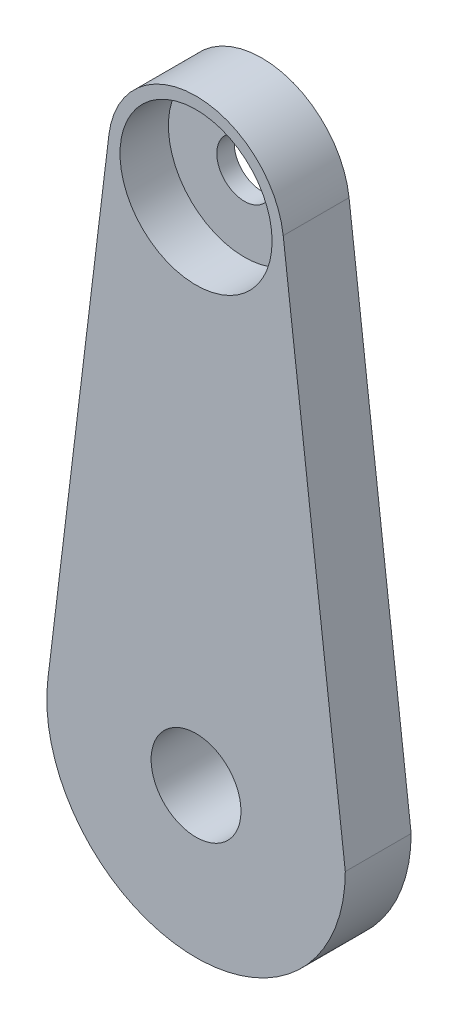
ISO-10303-21;
HEADER;
FILE_DESCRIPTION(('STEP AP214'),'2;1');
FILE_NAME('part.step','',(''),(''),'','','');
FILE_SCHEMA(('AUTOMOTIVE_DESIGN { 1 0 10303 214 1 1 1 1 }'));
ENDSEC;
DATA;
#1=APPLICATION_CONTEXT('core data for automotive mechanical design processes');
#2=APPLICATION_PROTOCOL_DEFINITION('international standard','automotive_design',2000,#1);
#3=PRODUCT_CONTEXT('',#1,'mechanical');
#4=PRODUCT('Part','Part','',(#3));
#5=PRODUCT_RELATED_PRODUCT_CATEGORY('part','',(#4));
#6=PRODUCT_DEFINITION_FORMATION('','',#4);
#7=PRODUCT_DEFINITION_CONTEXT('part definition',#1,'design');
#8=PRODUCT_DEFINITION('design','',#6,#7);
#9=PRODUCT_DEFINITION_SHAPE('','',#8);
#10=(LENGTH_UNIT() NAMED_UNIT(*) SI_UNIT(.MILLI.,.METRE.));
#11=(NAMED_UNIT(*) PLANE_ANGLE_UNIT() SI_UNIT($,.RADIAN.));
#12=(NAMED_UNIT(*) SI_UNIT($,.STERADIAN.) SOLID_ANGLE_UNIT());
#13=UNCERTAINTY_MEASURE_WITH_UNIT(LENGTH_MEASURE(1.E-05),#10,'distance_accuracy_value','');
#14=(GEOMETRIC_REPRESENTATION_CONTEXT(3) GLOBAL_UNCERTAINTY_ASSIGNED_CONTEXT((#13)) GLOBAL_UNIT_ASSIGNED_CONTEXT((#10,
#11,#12)) REPRESENTATION_CONTEXT('',''));
#15=CARTESIAN_POINT('',(0.,0.,0.));
#16=DIRECTION('',(0.,0.,1.));
#17=DIRECTION('',(1.,0.,0.));
#18=AXIS2_PLACEMENT_3D('',#15,#16,#17);
#19=CARTESIAN_POINT('',(0.,73.66,9.525));
#20=DIRECTION('',(0.,0.,-1.));
#21=DIRECTION('',(-1.,0.,0.));
#22=AXIS2_PLACEMENT_3D('',#19,#20,#21);
#23=CYLINDRICAL_SURFACE('',#22,11.);
#24=CARTESIAN_POINT('',(0.,73.66,2.52476));
#25=DIRECTION('',(0.,0.,1.));
#26=DIRECTION('',(1.,0.,0.));
#27=AXIS2_PLACEMENT_3D('',#24,#25,#26);
#28=CIRCLE('',#27,11.);
#29=CARTESIAN_POINT('',(11.,73.66,2.52476));
#30=VERTEX_POINT('',#29);
#31=EDGE_CURVE('E12',#30,#30,#28,.T.);
#32=ORIENTED_EDGE('',*,*,#31,.F.);
#33=EDGE_LOOP('',(#32));
#34=FACE_BOUND('',#33,.T.);
#35=CARTESIAN_POINT('',(0.,73.66,9.525));
#36=DIRECTION('',(0.,0.,1.));
#37=DIRECTION('',(1.,0.,0.));
#38=AXIS2_PLACEMENT_3D('',#35,#36,#37);
#39=CIRCLE('',#38,11.);
#40=CARTESIAN_POINT('',(11.,73.66,9.525));
#41=VERTEX_POINT('',#40);
#42=EDGE_CURVE('E119',#41,#41,#39,.T.);
#43=ORIENTED_EDGE('',*,*,#42,.T.);
#44=EDGE_LOOP('',(#43));
#45=FACE_BOUND('',#44,.T.);
#46=ADVANCED_FACE('F55',(#34,#45),#23,.F.);
#47=CARTESIAN_POINT('',(0.,73.66,9.525));
#48=DIRECTION('',(0.,0.,-1.));
#49=DIRECTION('',(-1.,0.,0.));
#50=AXIS2_PLACEMENT_3D('',#47,#48,#49);
#51=CYLINDRICAL_SURFACE('',#50,12.7);
#52=CARTESIAN_POINT('',(0.,73.66,0.));
#53=DIRECTION('',(0.,0.,1.));
#54=DIRECTION('',(1.,0.,0.));
#55=AXIS2_PLACEMENT_3D('',#52,#53,#54);
#56=CIRCLE('',#55,12.7);
#57=CARTESIAN_POINT('',(12.6103341085492,75.1664772387127,0.));
#58=VERTEX_POINT('',#57);
#59=CARTESIAN_POINT('',(-12.6071666527694,75.1927586206897,0.));
#60=VERTEX_POINT('',#59);
#61=EDGE_CURVE('E114',#58,#60,#56,.T.);
#62=ORIENTED_EDGE('',*,*,#61,.T.);
#63=DIRECTION('',(0.,0.,-1.));
#64=VECTOR('',#63,1.);
#65=CARTESIAN_POINT('',(-12.6071666527694,75.1927586206897,9.525));
#66=LINE('',#65,#64);
#67=CARTESIAN_POINT('',(-12.6071666527694,75.1927586206897,9.525));
#68=VERTEX_POINT('',#67);
#69=EDGE_CURVE('E111',#68,#60,#66,.T.);
#70=ORIENTED_EDGE('',*,*,#69,.F.);
#71=CARTESIAN_POINT('',(0.,73.66,9.525));
#72=DIRECTION('',(0.,0.,1.));
#73=DIRECTION('',(1.,0.,0.));
#74=AXIS2_PLACEMENT_3D('',#71,#72,#73);
#75=CIRCLE('',#74,12.7);
#76=CARTESIAN_POINT('',(12.6103341085492,75.1664772387127,9.525));
#77=VERTEX_POINT('',#76);
#78=EDGE_CURVE('E102',#77,#68,#75,.T.);
#79=ORIENTED_EDGE('',*,*,#78,.F.);
#80=DIRECTION('',(0.,0.,-1.));
#81=VECTOR('',#80,1.);
#82=CARTESIAN_POINT('',(12.6103341085492,75.1664772387127,9.525));
#83=LINE('',#82,#81);
#84=EDGE_CURVE('E64',#77,#58,#83,.T.);
#85=ORIENTED_EDGE('',*,*,#84,.T.);
#86=EDGE_LOOP('',(#62,#70,#79,#85));
#87=FACE_BOUND('',#86,.T.);
#88=ADVANCED_FACE('F112',(#87),#51,.T.);
#89=CARTESIAN_POINT('',(-21.432183309708,2.60568965517242,9.525));
#90=DIRECTION('',(0.99269028761964,-0.120689655172414,0.));
#91=DIRECTION('',(0.120689655172414,0.99269028761964,0.));
#92=AXIS2_PLACEMENT_3D('',#89,#90,#91);
#93=PLANE('',#92);
#94=DIRECTION('',(-0.120689655172414,-0.99269028761964,0.));
#95=VECTOR('',#94,1.);
#96=CARTESIAN_POINT('',(-21.432183309708,2.60568965517242,0.));
#97=LINE('',#96,#95);
#98=CARTESIAN_POINT('',(-21.432183309708,2.60568965517241,0.));
#99=VERTEX_POINT('',#98);
#100=EDGE_CURVE('E89',#60,#99,#97,.T.);
#101=ORIENTED_EDGE('',*,*,#100,.T.);
#102=DIRECTION('',(0.,0.,-1.));
#103=VECTOR('',#102,1.);
#104=CARTESIAN_POINT('',(-21.432183309708,2.60568965517241,9.525));
#105=LINE('',#104,#103);
#106=CARTESIAN_POINT('',(-21.432183309708,2.60568965517241,9.525));
#107=VERTEX_POINT('',#106);
#108=EDGE_CURVE('E115',#107,#99,#105,.T.);
#109=ORIENTED_EDGE('',*,*,#108,.F.);
#110=DIRECTION('',(-0.120689655172414,-0.99269028761964,0.));
#111=VECTOR('',#110,1.);
#112=CARTESIAN_POINT('',(-21.432183309708,2.60568965517242,9.525));
#113=LINE('',#112,#111);
#114=EDGE_CURVE('E107',#68,#107,#113,.T.);
#115=ORIENTED_EDGE('',*,*,#114,.F.);
#116=ORIENTED_EDGE('',*,*,#69,.T.);
#117=EDGE_LOOP('',(#101,#109,#115,#116));
#118=FACE_BOUND('',#117,.T.);
#119=ADVANCED_FACE('F117',(#118),#93,.F.);
#120=CARTESIAN_POINT('',(0.,0.,9.525));
#121=DIRECTION('',(0.,0.,-1.));
#122=DIRECTION('',(-1.,0.,0.));
#123=AXIS2_PLACEMENT_3D('',#120,#121,#122);
#124=CYLINDRICAL_SURFACE('',#123,21.59);
#125=CARTESIAN_POINT('',(0.,0.,0.));
#126=DIRECTION('',(0.,0.,1.));
#127=DIRECTION('',(1.,0.,0.));
#128=AXIS2_PLACEMENT_3D('',#125,#126,#127);
#129=CIRCLE('',#128,21.59);
#130=CARTESIAN_POINT('',(21.59,0.,0.));
#131=VERTEX_POINT('',#130);
#132=EDGE_CURVE('E131',#99,#131,#129,.T.);
#133=ORIENTED_EDGE('',*,*,#132,.T.);
#134=DIRECTION('',(0.,0.,-1.));
#135=VECTOR('',#134,1.);
#136=CARTESIAN_POINT('',(21.59,0.,9.525));
#137=LINE('',#136,#135);
#138=CARTESIAN_POINT('',(21.59,0.,9.525));
#139=VERTEX_POINT('',#138);
#140=EDGE_CURVE('E96',#139,#131,#137,.T.);
#141=ORIENTED_EDGE('',*,*,#140,.F.);
#142=CARTESIAN_POINT('',(0.,0.,9.525));
#143=DIRECTION('',(0.,0.,1.));
#144=DIRECTION('',(1.,0.,0.));
#145=AXIS2_PLACEMENT_3D('',#142,#143,#144);
#146=CIRCLE('',#145,21.59);
#147=EDGE_CURVE('E72',#107,#139,#146,.T.);
#148=ORIENTED_EDGE('',*,*,#147,.F.);
#149=ORIENTED_EDGE('',*,*,#108,.T.);
#150=EDGE_LOOP('',(#133,#141,#148,#149));
#151=FACE_BOUND('',#150,.T.);
#152=ADVANCED_FACE('F138',(#151),#124,.T.);
#153=CARTESIAN_POINT('',(21.2862121858038,2.54292978126428,9.525));
#154=DIRECTION('',(0.992939693586555,0.118620255016749,0.));
#155=DIRECTION('',(-0.118620255016749,0.992939693586555,0.));
#156=AXIS2_PLACEMENT_3D('',#153,#154,#155);
#157=PLANE('',#156);
#158=DIRECTION('',(0.118620255016749,-0.992939693586555,0.));
#159=VECTOR('',#158,1.);
#160=CARTESIAN_POINT('',(21.2862121858038,2.54292978126428,0.));
#161=LINE('',#160,#159);
#162=EDGE_CURVE('E125',#58,#131,#161,.T.);
#163=ORIENTED_EDGE('',*,*,#162,.F.);
#164=ORIENTED_EDGE('',*,*,#84,.F.);
#165=DIRECTION('',(0.118620255016749,-0.992939693586555,0.));
#166=VECTOR('',#165,1.);
#167=CARTESIAN_POINT('',(21.2862121858038,2.54292978126428,9.525));
#168=LINE('',#167,#166);
#169=EDGE_CURVE('E108',#77,#139,#168,.T.);
#170=ORIENTED_EDGE('',*,*,#169,.T.);
#171=ORIENTED_EDGE('',*,*,#140,.T.);
#172=EDGE_LOOP('',(#163,#164,#170,#171));
#173=FACE_BOUND('',#172,.T.);
#174=ADVANCED_FACE('F57',(#173),#157,.T.);
#175=CARTESIAN_POINT('',(0.,0.,0.));
#176=DIRECTION('',(0.,0.,1.));
#177=DIRECTION('',(1.,0.,0.));
#178=AXIS2_PLACEMENT_3D('',#175,#176,#177);
#179=PLANE('',#178);
#180=CARTESIAN_POINT('',(0.,0.,0.));
#181=DIRECTION('',(0.,0.,1.));
#182=DIRECTION('',(1.,0.,0.));
#183=AXIS2_PLACEMENT_3D('',#180,#181,#182);
#184=CIRCLE('',#183,6.5);
#185=CARTESIAN_POINT('',(6.5,0.,0.));
#186=VERTEX_POINT('',#185);
#187=EDGE_CURVE('E266',#186,#186,#184,.T.);
#188=ORIENTED_EDGE('',*,*,#187,.T.);
#189=EDGE_LOOP('',(#188));
#190=FACE_BOUND('',#189,.T.);
#191=CARTESIAN_POINT('',(0.,73.66,0.));
#192=DIRECTION('',(0.,0.,1.));
#193=DIRECTION('',(1.,0.,0.));
#194=AXIS2_PLACEMENT_3D('',#191,#192,#193);
#195=CIRCLE('',#194,4.);
#196=CARTESIAN_POINT('',(4.,73.66,0.));
#197=VERTEX_POINT('',#196);
#198=EDGE_CURVE('E128',#197,#197,#195,.T.);
#199=ORIENTED_EDGE('',*,*,#198,.T.);
#200=EDGE_LOOP('',(#199));
#201=FACE_BOUND('',#200,.T.);
#202=ORIENTED_EDGE('',*,*,#162,.T.);
#203=ORIENTED_EDGE('',*,*,#132,.F.);
#204=ORIENTED_EDGE('',*,*,#100,.F.);
#205=ORIENTED_EDGE('',*,*,#61,.F.);
#206=EDGE_LOOP('',(#202,#203,#204,#205));
#207=FACE_BOUND('',#206,.T.);
#208=ADVANCED_FACE('F135',(#190,#201,#207),#179,.F.);
#209=CARTESIAN_POINT('',(0.,0.,9.525));
#210=DIRECTION('',(0.,0.,1.));
#211=DIRECTION('',(1.,0.,0.));
#212=AXIS2_PLACEMENT_3D('',#209,#210,#211);
#213=PLANE('',#212);
#214=CARTESIAN_POINT('',(0.,0.,9.525));
#215=DIRECTION('',(0.,0.,1.));
#216=DIRECTION('',(1.,0.,0.));
#217=AXIS2_PLACEMENT_3D('',#214,#215,#216);
#218=CIRCLE('',#217,6.5);
#219=CARTESIAN_POINT('',(6.5,0.,9.525));
#220=VERTEX_POINT('',#219);
#221=EDGE_CURVE('E269',#220,#220,#218,.T.);
#222=ORIENTED_EDGE('',*,*,#221,.F.);
#223=EDGE_LOOP('',(#222));
#224=FACE_BOUND('',#223,.T.);
#225=ORIENTED_EDGE('',*,*,#169,.F.);
#226=ORIENTED_EDGE('',*,*,#78,.T.);
#227=ORIENTED_EDGE('',*,*,#114,.T.);
#228=ORIENTED_EDGE('',*,*,#147,.T.);
#229=EDGE_LOOP('',(#225,#226,#227,#228));
#230=FACE_BOUND('',#229,.T.);
#231=ORIENTED_EDGE('',*,*,#42,.F.);
#232=EDGE_LOOP('',(#231));
#233=FACE_BOUND('',#232,.T.);
#234=ADVANCED_FACE('F104',(#224,#230,#233),#213,.T.);
#235=CARTESIAN_POINT('',(0.,0.,2.52476));
#236=DIRECTION('',(0.,0.,1.));
#237=DIRECTION('',(1.,0.,0.));
#238=AXIS2_PLACEMENT_3D('',#235,#236,#237);
#239=PLANE('',#238);
#240=CARTESIAN_POINT('',(0.,73.66,2.52476));
#241=DIRECTION('',(0.,0.,1.));
#242=DIRECTION('',(1.,0.,0.));
#243=AXIS2_PLACEMENT_3D('',#240,#241,#242);
#244=CIRCLE('',#243,4.);
#245=CARTESIAN_POINT('',(4.,73.66,2.52476));
#246=VERTEX_POINT('',#245);
#247=EDGE_CURVE('E271',#246,#246,#244,.T.);
#248=ORIENTED_EDGE('',*,*,#247,.F.);
#249=EDGE_LOOP('',(#248));
#250=FACE_BOUND('',#249,.T.);
#251=ORIENTED_EDGE('',*,*,#31,.T.);
#252=EDGE_LOOP('',(#251));
#253=FACE_BOUND('',#252,.T.);
#254=ADVANCED_FACE('F184',(#250,#253),#239,.T.);
#255=CARTESIAN_POINT('',(0.,73.66,0.));
#256=DIRECTION('',(0.,0.,1.));
#257=DIRECTION('',(1.,0.,0.));
#258=AXIS2_PLACEMENT_3D('',#255,#256,#257);
#259=CYLINDRICAL_SURFACE('',#258,4.);
#260=ORIENTED_EDGE('',*,*,#198,.F.);
#261=EDGE_LOOP('',(#260));
#262=FACE_BOUND('',#261,.T.);
#263=ORIENTED_EDGE('',*,*,#247,.T.);
#264=EDGE_LOOP('',(#263));
#265=FACE_BOUND('',#264,.T.);
#266=ADVANCED_FACE('F189',(#262,#265),#259,.F.);
#267=CARTESIAN_POINT('',(0.,0.,0.));
#268=DIRECTION('',(0.,0.,1.));
#269=DIRECTION('',(1.,0.,0.));
#270=AXIS2_PLACEMENT_3D('',#267,#268,#269);
#271=CYLINDRICAL_SURFACE('',#270,6.5);
#272=ORIENTED_EDGE('',*,*,#187,.F.);
#273=EDGE_LOOP('',(#272));
#274=FACE_BOUND('',#273,.T.);
#275=ORIENTED_EDGE('',*,*,#221,.T.);
#276=EDGE_LOOP('',(#275));
#277=FACE_BOUND('',#276,.T.);
#278=ADVANCED_FACE('F202',(#274,#277),#271,.F.);
#279=CLOSED_SHELL('',(#46,#88,#119,#152,#174,#208,#234,#254,#266,#278));
#280=MANIFOLD_SOLID_BREP('B2',#279);
#281=ADVANCED_BREP_SHAPE_REPRESENTATION('',(#18,#280),#14);
#282=SHAPE_DEFINITION_REPRESENTATION(#9,#281);
ENDSEC;
END-ISO-10303-21;
